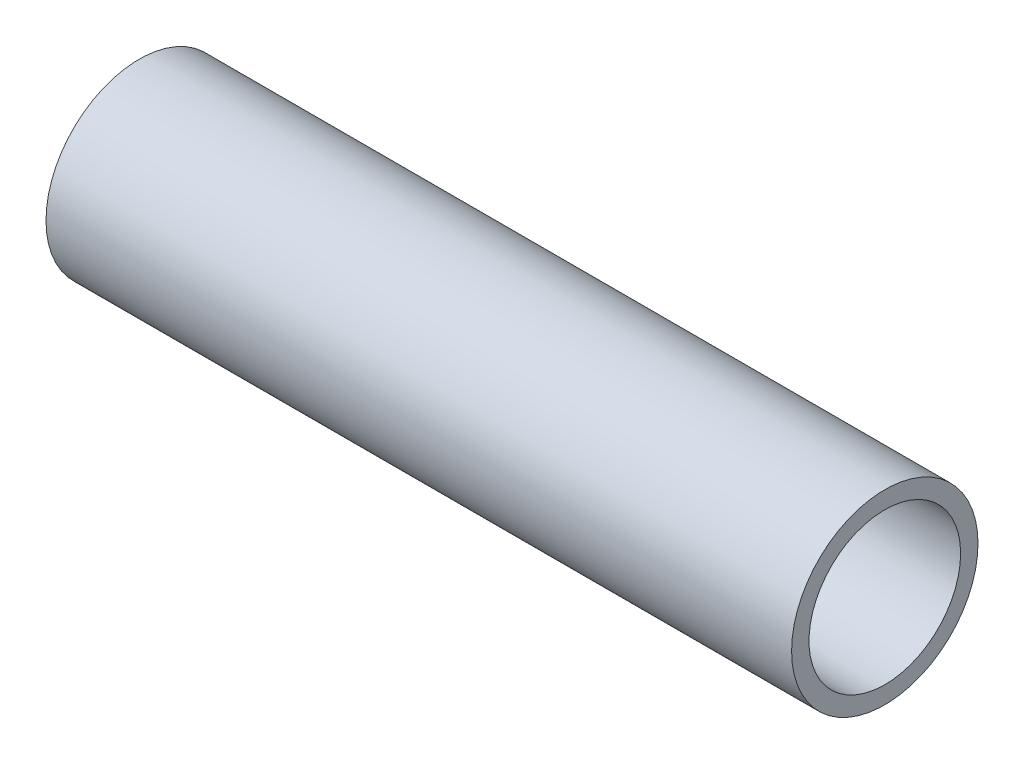
ISO-10303-21;
HEADER;
FILE_DESCRIPTION(('STEP AP214'),'2;1');
FILE_NAME('part.step','',(''),(''),'','','');
FILE_SCHEMA(('AUTOMOTIVE_DESIGN { 1 0 10303 214 1 1 1 1 }'));
ENDSEC;
DATA;
#1=APPLICATION_CONTEXT('core data for automotive mechanical design processes');
#2=APPLICATION_PROTOCOL_DEFINITION('international standard','automotive_design',2000,#1);
#3=PRODUCT_CONTEXT('',#1,'mechanical');
#4=PRODUCT('Part','Part','',(#3));
#5=PRODUCT_RELATED_PRODUCT_CATEGORY('part','',(#4));
#6=PRODUCT_DEFINITION_FORMATION('','',#4);
#7=PRODUCT_DEFINITION_CONTEXT('part definition',#1,'design');
#8=PRODUCT_DEFINITION('design','',#6,#7);
#9=PRODUCT_DEFINITION_SHAPE('','',#8);
#10=(LENGTH_UNIT() NAMED_UNIT(*) SI_UNIT(.MILLI.,.METRE.));
#11=(NAMED_UNIT(*) PLANE_ANGLE_UNIT() SI_UNIT($,.RADIAN.));
#12=(NAMED_UNIT(*) SI_UNIT($,.STERADIAN.) SOLID_ANGLE_UNIT());
#13=UNCERTAINTY_MEASURE_WITH_UNIT(LENGTH_MEASURE(1.E-05),#10,'distance_accuracy_value','');
#14=(GEOMETRIC_REPRESENTATION_CONTEXT(3) GLOBAL_UNCERTAINTY_ASSIGNED_CONTEXT((#13)) GLOBAL_UNIT_ASSIGNED_CONTEXT((#10,
#11,#12)) REPRESENTATION_CONTEXT('',''));
#15=CARTESIAN_POINT('',(0.,0.,0.));
#16=DIRECTION('',(0.,0.,1.));
#17=DIRECTION('',(1.,0.,0.));
#18=AXIS2_PLACEMENT_3D('',#15,#16,#17);
#19=CARTESIAN_POINT('',(19.05,0.,0.));
#20=DIRECTION('',(1.,0.,0.));
#21=DIRECTION('',(0.,0.,-1.));
#22=AXIS2_PLACEMENT_3D('',#19,#20,#21);
#23=PLANE('',#22);
#24=CARTESIAN_POINT('',(19.05,0.,0.));
#25=DIRECTION('',(1.,0.,0.));
#26=DIRECTION('',(0.,0.,-1.));
#27=AXIS2_PLACEMENT_3D('',#24,#25,#26);
#28=CIRCLE('',#27,4.7625);
#29=CARTESIAN_POINT('',(19.05,0.,-4.7625));
#30=VERTEX_POINT('',#29);
#31=EDGE_CURVE('E10',#30,#30,#28,.T.);
#32=ORIENTED_EDGE('',*,*,#31,.T.);
#33=EDGE_LOOP('',(#32));
#34=FACE_BOUND('',#33,.T.);
#35=CARTESIAN_POINT('',(19.05,0.,0.));
#36=DIRECTION('',(1.,0.,0.));
#37=DIRECTION('',(0.,0.,-1.));
#38=AXIS2_PLACEMENT_3D('',#35,#36,#37);
#39=CIRCLE('',#38,3.8735);
#40=CARTESIAN_POINT('',(19.05,0.,-3.8735));
#41=VERTEX_POINT('',#40);
#42=EDGE_CURVE('E43',#41,#41,#39,.T.);
#43=ORIENTED_EDGE('',*,*,#42,.F.);
#44=EDGE_LOOP('',(#43));
#45=FACE_BOUND('',#44,.T.);
#46=ADVANCED_FACE('F32',(#34,#45),#23,.T.);
#47=CARTESIAN_POINT('',(-19.05,0.,0.));
#48=DIRECTION('',(1.,0.,0.));
#49=DIRECTION('',(0.,0.,-1.));
#50=AXIS2_PLACEMENT_3D('',#47,#48,#49);
#51=PLANE('',#50);
#52=CARTESIAN_POINT('',(-19.05,0.,0.));
#53=DIRECTION('',(1.,0.,0.));
#54=DIRECTION('',(0.,0.,-1.));
#55=AXIS2_PLACEMENT_3D('',#52,#53,#54);
#56=CIRCLE('',#55,4.7625);
#57=CARTESIAN_POINT('',(-19.05,0.,-4.7625));
#58=VERTEX_POINT('',#57);
#59=EDGE_CURVE('E36',#58,#58,#56,.T.);
#60=ORIENTED_EDGE('',*,*,#59,.F.);
#61=EDGE_LOOP('',(#60));
#62=FACE_BOUND('',#61,.T.);
#63=CARTESIAN_POINT('',(-19.05,0.,0.));
#64=DIRECTION('',(1.,0.,0.));
#65=DIRECTION('',(0.,0.,-1.));
#66=AXIS2_PLACEMENT_3D('',#63,#64,#65);
#67=CIRCLE('',#66,3.8735);
#68=CARTESIAN_POINT('',(-19.05,0.,-3.8735));
#69=VERTEX_POINT('',#68);
#70=EDGE_CURVE('E45',#69,#69,#67,.T.);
#71=ORIENTED_EDGE('',*,*,#70,.T.);
#72=EDGE_LOOP('',(#71));
#73=FACE_BOUND('',#72,.T.);
#74=ADVANCED_FACE('F55',(#62,#73),#51,.F.);
#75=CARTESIAN_POINT('',(19.05,0.,0.));
#76=DIRECTION('',(-1.,0.,0.));
#77=DIRECTION('',(0.,0.,1.));
#78=AXIS2_PLACEMENT_3D('',#75,#76,#77);
#79=CYLINDRICAL_SURFACE('',#78,4.7625);
#80=ORIENTED_EDGE('',*,*,#31,.F.);
#81=EDGE_LOOP('',(#80));
#82=FACE_BOUND('',#81,.T.);
#83=ORIENTED_EDGE('',*,*,#59,.T.);
#84=EDGE_LOOP('',(#83));
#85=FACE_BOUND('',#84,.T.);
#86=ADVANCED_FACE('F34',(#82,#85),#79,.T.);
#87=CARTESIAN_POINT('',(19.05,0.,0.));
#88=DIRECTION('',(-1.,0.,0.));
#89=DIRECTION('',(0.,0.,1.));
#90=AXIS2_PLACEMENT_3D('',#87,#88,#89);
#91=CYLINDRICAL_SURFACE('',#90,3.8735);
#92=ORIENTED_EDGE('',*,*,#42,.T.);
#93=EDGE_LOOP('',(#92));
#94=FACE_BOUND('',#93,.T.);
#95=ORIENTED_EDGE('',*,*,#70,.F.);
#96=EDGE_LOOP('',(#95));
#97=FACE_BOUND('',#96,.T.);
#98=ADVANCED_FACE('F51',(#94,#97),#91,.F.);
#99=CLOSED_SHELL('',(#46,#74,#86,#98));
#100=MANIFOLD_SOLID_BREP('B2',#99);
#101=ADVANCED_BREP_SHAPE_REPRESENTATION('',(#18,#100),#14);
#102=SHAPE_DEFINITION_REPRESENTATION(#9,#101);
ENDSEC;
END-ISO-10303-21;
